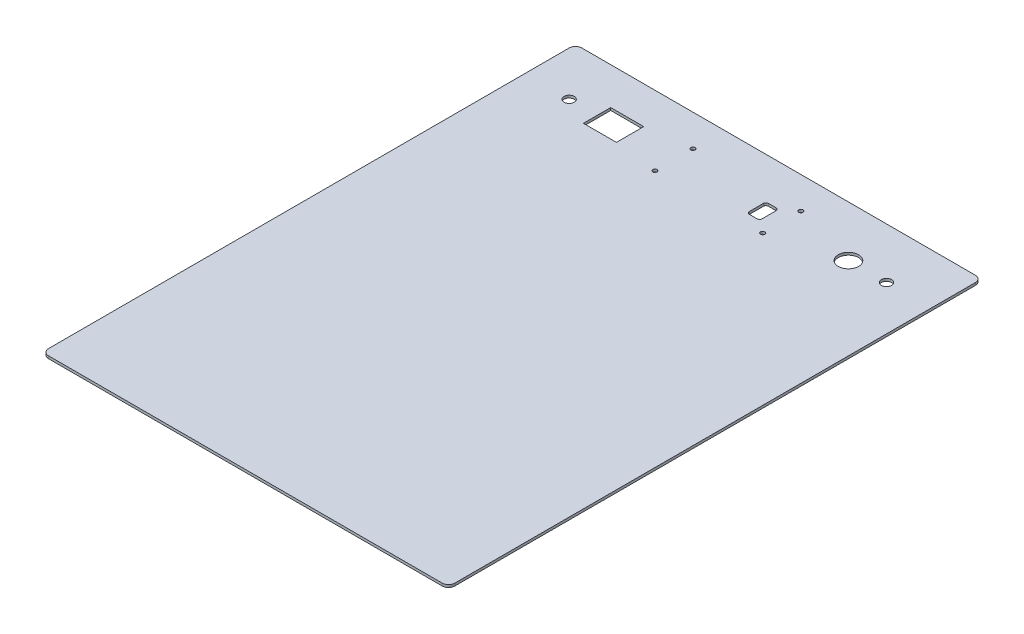
ISO-10303-21;
HEADER;
FILE_DESCRIPTION(('STEP AP214'),'2;1');
FILE_NAME('part.step','',(''),(''),'','','');
FILE_SCHEMA(('AUTOMOTIVE_DESIGN { 1 0 10303 214 1 1 1 1 }'));
ENDSEC;
DATA;
#1=APPLICATION_CONTEXT('core data for automotive mechanical design processes');
#2=APPLICATION_PROTOCOL_DEFINITION('international standard','automotive_design',2000,#1);
#3=PRODUCT_CONTEXT('',#1,'mechanical');
#4=PRODUCT('Part','Part','',(#3));
#5=PRODUCT_RELATED_PRODUCT_CATEGORY('part','',(#4));
#6=PRODUCT_DEFINITION_FORMATION('','',#4);
#7=PRODUCT_DEFINITION_CONTEXT('part definition',#1,'design');
#8=PRODUCT_DEFINITION('design','',#6,#7);
#9=PRODUCT_DEFINITION_SHAPE('','',#8);
#10=(LENGTH_UNIT() NAMED_UNIT(*) SI_UNIT(.MILLI.,.METRE.));
#11=(NAMED_UNIT(*) PLANE_ANGLE_UNIT() SI_UNIT($,.RADIAN.));
#12=(NAMED_UNIT(*) SI_UNIT($,.STERADIAN.) SOLID_ANGLE_UNIT());
#13=UNCERTAINTY_MEASURE_WITH_UNIT(LENGTH_MEASURE(1.E-05),#10,'distance_accuracy_value','');
#14=(GEOMETRIC_REPRESENTATION_CONTEXT(3) GLOBAL_UNCERTAINTY_ASSIGNED_CONTEXT((#13)) GLOBAL_UNIT_ASSIGNED_CONTEXT((#10,
#11,#12)) REPRESENTATION_CONTEXT('',''));
#15=CARTESIAN_POINT('',(0.,0.,0.));
#16=DIRECTION('',(0.,0.,1.));
#17=DIRECTION('',(1.,0.,0.));
#18=AXIS2_PLACEMENT_3D('',#15,#16,#17);
#19=CARTESIAN_POINT('',(160.,2.,-210.));
#20=DIRECTION('',(-1.,0.,0.));
#21=DIRECTION('',(0.,0.,1.));
#22=AXIS2_PLACEMENT_3D('',#19,#20,#21);
#23=PLANE('',#22);
#24=DIRECTION('',(0.,0.,-1.));
#25=VECTOR('',#24,1.);
#26=CARTESIAN_POINT('',(160.,2.,-210.));
#27=LINE('',#26,#25);
#28=CARTESIAN_POINT('',(160.,2.,205.));
#29=VERTEX_POINT('',#28);
#30=CARTESIAN_POINT('',(160.,2.,-205.));
#31=VERTEX_POINT('',#30);
#32=EDGE_CURVE('E266',#29,#31,#27,.T.);
#33=ORIENTED_EDGE('',*,*,#32,.F.);
#34=DIRECTION('',(0.,-1.,0.));
#35=VECTOR('',#34,1.);
#36=CARTESIAN_POINT('',(160.,2.,205.));
#37=LINE('',#36,#35);
#38=CARTESIAN_POINT('',(160.,0.,205.));
#39=VERTEX_POINT('',#38);
#40=EDGE_CURVE('E291',#29,#39,#37,.T.);
#41=ORIENTED_EDGE('',*,*,#40,.T.);
#42=DIRECTION('',(0.,0.,-1.));
#43=VECTOR('',#42,1.);
#44=CARTESIAN_POINT('',(160.,0.,-210.));
#45=LINE('',#44,#43);
#46=CARTESIAN_POINT('',(160.,0.,-205.));
#47=VERTEX_POINT('',#46);
#48=EDGE_CURVE('E255',#39,#47,#45,.T.);
#49=ORIENTED_EDGE('',*,*,#48,.T.);
#50=DIRECTION('',(0.,-1.,0.));
#51=VECTOR('',#50,1.);
#52=CARTESIAN_POINT('',(160.,2.,-205.));
#53=LINE('',#52,#51);
#54=EDGE_CURVE('E279',#47,#31,#53,.F.);
#55=ORIENTED_EDGE('',*,*,#54,.T.);
#56=EDGE_LOOP('',(#33,#41,#49,#55));
#57=FACE_BOUND('',#56,.T.);
#58=ADVANCED_FACE('F33',(#57),#23,.F.);
#59=CARTESIAN_POINT('',(-160.,2.,-210.));
#60=DIRECTION('',(0.,0.,1.));
#61=DIRECTION('',(1.,0.,0.));
#62=AXIS2_PLACEMENT_3D('',#59,#60,#61);
#63=PLANE('',#62);
#64=DIRECTION('',(-1.,0.,0.));
#65=VECTOR('',#64,1.);
#66=CARTESIAN_POINT('',(-160.,0.,-210.));
#67=LINE('',#66,#65);
#68=CARTESIAN_POINT('',(155.,0.,-210.));
#69=VERTEX_POINT('',#68);
#70=CARTESIAN_POINT('',(-155.,0.,-210.));
#71=VERTEX_POINT('',#70);
#72=EDGE_CURVE('E282',#69,#71,#67,.T.);
#73=ORIENTED_EDGE('',*,*,#72,.T.);
#74=DIRECTION('',(0.,-1.,0.));
#75=VECTOR('',#74,1.);
#76=CARTESIAN_POINT('',(-155.,2.,-210.));
#77=LINE('',#76,#75);
#78=CARTESIAN_POINT('',(-155.,2.,-210.));
#79=VERTEX_POINT('',#78);
#80=EDGE_CURVE('E323',#71,#79,#77,.F.);
#81=ORIENTED_EDGE('',*,*,#80,.T.);
#82=DIRECTION('',(-1.,0.,0.));
#83=VECTOR('',#82,1.);
#84=CARTESIAN_POINT('',(-160.,2.,-210.));
#85=LINE('',#84,#83);
#86=CARTESIAN_POINT('',(155.,2.,-210.));
#87=VERTEX_POINT('',#86);
#88=EDGE_CURVE('E269',#87,#79,#85,.T.);
#89=ORIENTED_EDGE('',*,*,#88,.F.);
#90=DIRECTION('',(0.,-1.,0.));
#91=VECTOR('',#90,1.);
#92=CARTESIAN_POINT('',(155.,2.,-210.));
#93=LINE('',#92,#91);
#94=EDGE_CURVE('E320',#87,#69,#93,.T.);
#95=ORIENTED_EDGE('',*,*,#94,.T.);
#96=EDGE_LOOP('',(#73,#81,#89,#95));
#97=FACE_BOUND('',#96,.T.);
#98=ADVANCED_FACE('F394',(#97),#63,.F.);
#99=CARTESIAN_POINT('',(-160.,2.,-210.));
#100=DIRECTION('',(1.,0.,0.));
#101=DIRECTION('',(0.,0.,-1.));
#102=AXIS2_PLACEMENT_3D('',#99,#100,#101);
#103=PLANE('',#102);
#104=DIRECTION('',(0.,0.,1.));
#105=VECTOR('',#104,1.);
#106=CARTESIAN_POINT('',(-160.,0.,-210.));
#107=LINE('',#106,#105);
#108=CARTESIAN_POINT('',(-160.,0.,-205.));
#109=VERTEX_POINT('',#108);
#110=CARTESIAN_POINT('',(-160.,0.,205.));
#111=VERTEX_POINT('',#110);
#112=EDGE_CURVE('E285',#109,#111,#107,.T.);
#113=ORIENTED_EDGE('',*,*,#112,.T.);
#114=DIRECTION('',(0.,-1.,0.));
#115=VECTOR('',#114,1.);
#116=CARTESIAN_POINT('',(-160.,2.,205.));
#117=LINE('',#116,#115);
#118=CARTESIAN_POINT('',(-160.,2.,205.));
#119=VERTEX_POINT('',#118);
#120=EDGE_CURVE('E318',#111,#119,#117,.F.);
#121=ORIENTED_EDGE('',*,*,#120,.T.);
#122=DIRECTION('',(0.,0.,1.));
#123=VECTOR('',#122,1.);
#124=CARTESIAN_POINT('',(-160.,2.,-210.));
#125=LINE('',#124,#123);
#126=CARTESIAN_POINT('',(-160.,2.,-205.));
#127=VERTEX_POINT('',#126);
#128=EDGE_CURVE('E273',#127,#119,#125,.T.);
#129=ORIENTED_EDGE('',*,*,#128,.F.);
#130=DIRECTION('',(0.,-1.,0.));
#131=VECTOR('',#130,1.);
#132=CARTESIAN_POINT('',(-160.,2.,-205.));
#133=LINE('',#132,#131);
#134=EDGE_CURVE('E315',#127,#109,#133,.T.);
#135=ORIENTED_EDGE('',*,*,#134,.T.);
#136=EDGE_LOOP('',(#113,#121,#129,#135));
#137=FACE_BOUND('',#136,.T.);
#138=ADVANCED_FACE('F400',(#137),#103,.F.);
#139=CARTESIAN_POINT('',(-160.,2.,210.));
#140=DIRECTION('',(0.,0.,-1.));
#141=DIRECTION('',(-1.,0.,0.));
#142=AXIS2_PLACEMENT_3D('',#139,#140,#141);
#143=PLANE('',#142);
#144=DIRECTION('',(1.,0.,0.));
#145=VECTOR('',#144,1.);
#146=CARTESIAN_POINT('',(-160.,0.,210.));
#147=LINE('',#146,#145);
#148=CARTESIAN_POINT('',(-155.,0.,210.));
#149=VERTEX_POINT('',#148);
#150=CARTESIAN_POINT('',(155.,0.,210.));
#151=VERTEX_POINT('',#150);
#152=EDGE_CURVE('E270',#149,#151,#147,.T.);
#153=ORIENTED_EDGE('',*,*,#152,.T.);
#154=DIRECTION('',(0.,-1.,0.));
#155=VECTOR('',#154,1.);
#156=CARTESIAN_POINT('',(155.,2.,210.));
#157=LINE('',#156,#155);
#158=CARTESIAN_POINT('',(155.,2.,210.));
#159=VERTEX_POINT('',#158);
#160=EDGE_CURVE('E305',#151,#159,#157,.F.);
#161=ORIENTED_EDGE('',*,*,#160,.T.);
#162=DIRECTION('',(1.,0.,0.));
#163=VECTOR('',#162,1.);
#164=CARTESIAN_POINT('',(-160.,2.,210.));
#165=LINE('',#164,#163);
#166=CARTESIAN_POINT('',(-155.,2.,210.));
#167=VERTEX_POINT('',#166);
#168=EDGE_CURVE('E276',#167,#159,#165,.T.);
#169=ORIENTED_EDGE('',*,*,#168,.F.);
#170=DIRECTION('',(0.,-1.,0.));
#171=VECTOR('',#170,1.);
#172=CARTESIAN_POINT('',(-155.,2.,210.));
#173=LINE('',#172,#171);
#174=EDGE_CURVE('E302',#167,#149,#173,.T.);
#175=ORIENTED_EDGE('',*,*,#174,.T.);
#176=EDGE_LOOP('',(#153,#161,#169,#175));
#177=FACE_BOUND('',#176,.T.);
#178=ADVANCED_FACE('F604',(#177),#143,.F.);
#179=CARTESIAN_POINT('',(0.,2.,0.));
#180=DIRECTION('',(0.,1.,0.));
#181=DIRECTION('',(0.,0.,1.));
#182=AXIS2_PLACEMENT_3D('',#179,#180,#181);
#183=PLANE('',#182);
#184=CARTESIAN_POINT('',(125.,2.,-170.));
#185=DIRECTION('',(0.,1.,0.));
#186=DIRECTION('',(0.,0.,1.));
#187=AXIS2_PLACEMENT_3D('',#184,#185,#186);
#188=CIRCLE('',#187,3.99999999999999);
#189=CARTESIAN_POINT('',(125.,2.,-166.));
#190=VERTEX_POINT('',#189);
#191=EDGE_CURVE('E202',#190,#190,#188,.T.);
#192=ORIENTED_EDGE('',*,*,#191,.F.);
#193=EDGE_LOOP('',(#192));
#194=FACE_BOUND('',#193,.T.);
#195=CARTESIAN_POINT('',(95.0000000000001,2.,-170.));
#196=DIRECTION('',(0.,1.,0.));
#197=DIRECTION('',(0.,0.,1.));
#198=AXIS2_PLACEMENT_3D('',#195,#196,#197);
#199=CIRCLE('',#198,8.00000000000001);
#200=CARTESIAN_POINT('',(95.0000000000001,2.,-162.));
#201=VERTEX_POINT('',#200);
#202=EDGE_CURVE('E678',#201,#201,#199,.T.);
#203=ORIENTED_EDGE('',*,*,#202,.F.);
#204=EDGE_LOOP('',(#203));
#205=FACE_BOUND('',#204,.T.);
#206=CARTESIAN_POINT('',(-125.,2.,-170.));
#207=DIRECTION('',(0.,1.,0.));
#208=DIRECTION('',(0.,0.,1.));
#209=AXIS2_PLACEMENT_3D('',#206,#207,#208);
#210=CIRCLE('',#209,3.99999999999999);
#211=CARTESIAN_POINT('',(-125.,2.,-166.));
#212=VERTEX_POINT('',#211);
#213=EDGE_CURVE('E682',#212,#212,#210,.T.);
#214=ORIENTED_EDGE('',*,*,#213,.F.);
#215=EDGE_LOOP('',(#214));
#216=FACE_BOUND('',#215,.T.);
#217=DIRECTION('',(0.,0.,-1.));
#218=VECTOR('',#217,1.);
#219=CARTESIAN_POINT('',(-77.,2.,-180.75));
#220=LINE('',#219,#218);
#221=CARTESIAN_POINT('',(-77.,2.,-159.25));
#222=VERTEX_POINT('',#221);
#223=CARTESIAN_POINT('',(-77.,2.,-180.75));
#224=VERTEX_POINT('',#223);
#225=EDGE_CURVE('E178',#222,#224,#220,.T.);
#226=ORIENTED_EDGE('',*,*,#225,.F.);
#227=DIRECTION('',(1.,0.,0.));
#228=VECTOR('',#227,1.);
#229=CARTESIAN_POINT('',(-103.,2.,-159.25));
#230=LINE('',#229,#228);
#231=CARTESIAN_POINT('',(-103.,2.,-159.25));
#232=VERTEX_POINT('',#231);
#233=EDGE_CURVE('E196',#232,#222,#230,.T.);
#234=ORIENTED_EDGE('',*,*,#233,.F.);
#235=DIRECTION('',(0.,0.,1.));
#236=VECTOR('',#235,1.);
#237=CARTESIAN_POINT('',(-103.,2.,-180.75));
#238=LINE('',#237,#236);
#239=CARTESIAN_POINT('',(-103.,2.,-180.75));
#240=VERTEX_POINT('',#239);
#241=EDGE_CURVE('E199',#240,#232,#238,.T.);
#242=ORIENTED_EDGE('',*,*,#241,.F.);
#243=DIRECTION('',(-1.,0.,0.));
#244=VECTOR('',#243,1.);
#245=CARTESIAN_POINT('',(-103.,2.,-180.75));
#246=LINE('',#245,#244);
#247=EDGE_CURVE('E208',#224,#240,#246,.T.);
#248=ORIENTED_EDGE('',*,*,#247,.F.);
#249=EDGE_LOOP('',(#226,#234,#242,#248));
#250=FACE_BOUND('',#249,.T.);
#251=CARTESIAN_POINT('',(42.5,2.,-155.));
#252=DIRECTION('',(0.,1.,0.));
#253=DIRECTION('',(0.,0.,1.));
#254=AXIS2_PLACEMENT_3D('',#251,#252,#253);
#255=CIRCLE('',#254,1.7);
#256=CARTESIAN_POINT('',(42.5,2.,-153.3));
#257=VERTEX_POINT('',#256);
#258=EDGE_CURVE('E238',#257,#257,#255,.T.);
#259=ORIENTED_EDGE('',*,*,#258,.F.);
#260=EDGE_LOOP('',(#259));
#261=FACE_BOUND('',#260,.T.);
#262=CARTESIAN_POINT('',(-42.5,2.,-155.));
#263=DIRECTION('',(0.,1.,0.));
#264=DIRECTION('',(0.,0.,1.));
#265=AXIS2_PLACEMENT_3D('',#262,#263,#264);
#266=CIRCLE('',#265,1.7);
#267=CARTESIAN_POINT('',(-42.5,2.,-153.3));
#268=VERTEX_POINT('',#267);
#269=EDGE_CURVE('E232',#268,#268,#266,.T.);
#270=ORIENTED_EDGE('',*,*,#269,.F.);
#271=EDGE_LOOP('',(#270));
#272=FACE_BOUND('',#271,.T.);
#273=CARTESIAN_POINT('',(-42.5,2.,-185.));
#274=DIRECTION('',(0.,1.,0.));
#275=DIRECTION('',(0.,0.,1.));
#276=AXIS2_PLACEMENT_3D('',#273,#274,#275);
#277=CIRCLE('',#276,1.7);
#278=CARTESIAN_POINT('',(-42.5,2.,-183.3));
#279=VERTEX_POINT('',#278);
#280=EDGE_CURVE('E226',#279,#279,#277,.T.);
#281=ORIENTED_EDGE('',*,*,#280,.F.);
#282=EDGE_LOOP('',(#281));
#283=FACE_BOUND('',#282,.T.);
#284=CARTESIAN_POINT('',(42.5,2.,-185.));
#285=DIRECTION('',(0.,1.,0.));
#286=DIRECTION('',(0.,0.,1.));
#287=AXIS2_PLACEMENT_3D('',#284,#285,#286);
#288=CIRCLE('',#287,1.7);
#289=CARTESIAN_POINT('',(42.5,2.,-183.3));
#290=VERTEX_POINT('',#289);
#291=EDGE_CURVE('E219',#290,#290,#288,.T.);
#292=ORIENTED_EDGE('',*,*,#291,.F.);
#293=EDGE_LOOP('',(#292));
#294=FACE_BOUND('',#293,.T.);
#295=DIRECTION('',(1.,0.,0.));
#296=VECTOR('',#295,1.);
#297=CARTESIAN_POINT('',(22.5,2.,-162.5));
#298=LINE('',#297,#296);
#299=CARTESIAN_POINT('',(24.5,2.,-162.5));
#300=VERTEX_POINT('',#299);
#301=CARTESIAN_POINT('',(30.5,2.,-162.5));
#302=VERTEX_POINT('',#301);
#303=EDGE_CURVE('E222',#300,#302,#298,.T.);
#304=ORIENTED_EDGE('',*,*,#303,.F.);
#305=CARTESIAN_POINT('',(24.5,2.,-164.5));
#306=DIRECTION('',(0.,1.,0.));
#307=DIRECTION('',(0.,0.,1.));
#308=AXIS2_PLACEMENT_3D('',#305,#306,#307);
#309=CIRCLE('',#308,2.);
#310=CARTESIAN_POINT('',(22.5,2.,-164.5));
#311=VERTEX_POINT('',#310);
#312=EDGE_CURVE('E344',#300,#311,#309,.F.);
#313=ORIENTED_EDGE('',*,*,#312,.T.);
#314=DIRECTION('',(0.,0.,1.));
#315=VECTOR('',#314,1.);
#316=CARTESIAN_POINT('',(22.5,2.,-177.5));
#317=LINE('',#316,#315);
#318=CARTESIAN_POINT('',(22.5,2.,-175.5));
#319=VERTEX_POINT('',#318);
#320=EDGE_CURVE('E247',#319,#311,#317,.T.);
#321=ORIENTED_EDGE('',*,*,#320,.F.);
#322=CARTESIAN_POINT('',(24.5,2.,-175.5));
#323=DIRECTION('',(0.,1.,0.));
#324=DIRECTION('',(0.,0.,1.));
#325=AXIS2_PLACEMENT_3D('',#322,#323,#324);
#326=CIRCLE('',#325,2.);
#327=CARTESIAN_POINT('',(24.5,2.,-177.5));
#328=VERTEX_POINT('',#327);
#329=EDGE_CURVE('E41',#319,#328,#326,.F.);
#330=ORIENTED_EDGE('',*,*,#329,.T.);
#331=DIRECTION('',(1.,0.,0.));
#332=VECTOR('',#331,1.);
#333=CARTESIAN_POINT('',(22.5,2.,-177.5));
#334=LINE('',#333,#332);
#335=CARTESIAN_POINT('',(30.5,2.,-177.5));
#336=VERTEX_POINT('',#335);
#337=EDGE_CURVE('E261',#328,#336,#334,.T.);
#338=ORIENTED_EDGE('',*,*,#337,.T.);
#339=CARTESIAN_POINT('',(30.5,2.,-175.5));
#340=DIRECTION('',(0.,1.,0.));
#341=DIRECTION('',(0.,0.,1.));
#342=AXIS2_PLACEMENT_3D('',#339,#340,#341);
#343=CIRCLE('',#342,2.);
#344=CARTESIAN_POINT('',(32.5,2.,-175.5));
#345=VERTEX_POINT('',#344);
#346=EDGE_CURVE('E352',#336,#345,#343,.F.);
#347=ORIENTED_EDGE('',*,*,#346,.T.);
#348=DIRECTION('',(0.,0.,1.));
#349=VECTOR('',#348,1.);
#350=CARTESIAN_POINT('',(32.5,2.,-177.5));
#351=LINE('',#350,#349);
#352=CARTESIAN_POINT('',(32.5,2.,-164.5));
#353=VERTEX_POINT('',#352);
#354=EDGE_CURVE('E258',#345,#353,#351,.T.);
#355=ORIENTED_EDGE('',*,*,#354,.T.);
#356=CARTESIAN_POINT('',(30.5,2.,-164.5));
#357=DIRECTION('',(0.,1.,0.));
#358=DIRECTION('',(0.,0.,1.));
#359=AXIS2_PLACEMENT_3D('',#356,#357,#358);
#360=CIRCLE('',#359,2.);
#361=EDGE_CURVE('E348',#353,#302,#360,.F.);
#362=ORIENTED_EDGE('',*,*,#361,.T.);
#363=EDGE_LOOP('',(#304,#313,#321,#330,#338,#347,#355,#362));
#364=FACE_BOUND('',#363,.T.);
#365=ORIENTED_EDGE('',*,*,#168,.T.);
#366=CARTESIAN_POINT('',(155.,2.,205.));
#367=DIRECTION('',(0.,1.,0.));
#368=DIRECTION('',(0.,0.,1.));
#369=AXIS2_PLACEMENT_3D('',#366,#367,#368);
#370=CIRCLE('',#369,5.);
#371=EDGE_CURVE('E313',#159,#29,#370,.T.);
#372=ORIENTED_EDGE('',*,*,#371,.T.);
#373=ORIENTED_EDGE('',*,*,#32,.T.);
#374=CARTESIAN_POINT('',(155.,2.,-205.));
#375=DIRECTION('',(0.,1.,0.));
#376=DIRECTION('',(0.,0.,1.));
#377=AXIS2_PLACEMENT_3D('',#374,#375,#376);
#378=CIRCLE('',#377,5.);
#379=EDGE_CURVE('E307',#31,#87,#378,.T.);
#380=ORIENTED_EDGE('',*,*,#379,.T.);
#381=ORIENTED_EDGE('',*,*,#88,.T.);
#382=CARTESIAN_POINT('',(-155.,2.,-205.));
#383=DIRECTION('',(0.,1.,0.));
#384=DIRECTION('',(0.,0.,1.));
#385=AXIS2_PLACEMENT_3D('',#382,#383,#384);
#386=CIRCLE('',#385,5.);
#387=EDGE_CURVE('E309',#79,#127,#386,.T.);
#388=ORIENTED_EDGE('',*,*,#387,.T.);
#389=ORIENTED_EDGE('',*,*,#128,.T.);
#390=CARTESIAN_POINT('',(-155.,2.,205.));
#391=DIRECTION('',(0.,1.,0.));
#392=DIRECTION('',(0.,0.,1.));
#393=AXIS2_PLACEMENT_3D('',#390,#391,#392);
#394=CIRCLE('',#393,5.);
#395=EDGE_CURVE('E311',#119,#167,#394,.T.);
#396=ORIENTED_EDGE('',*,*,#395,.T.);
#397=EDGE_LOOP('',(#365,#372,#373,#380,#381,#388,#389,#396));
#398=FACE_BOUND('',#397,.T.);
#399=ADVANCED_FACE('F357',(#194,#205,#216,#250,#261,#272,#283,#294,#364,#398),#183,.T.);
#400=CARTESIAN_POINT('',(0.,0.,0.));
#401=DIRECTION('',(0.,1.,0.));
#402=DIRECTION('',(0.,0.,1.));
#403=AXIS2_PLACEMENT_3D('',#400,#401,#402);
#404=PLANE('',#403);
#405=CARTESIAN_POINT('',(125.,0.,-170.));
#406=DIRECTION('',(0.,1.,0.));
#407=DIRECTION('',(0.,0.,1.));
#408=AXIS2_PLACEMENT_3D('',#405,#406,#407);
#409=CIRCLE('',#408,3.99999999999999);
#410=CARTESIAN_POINT('',(125.,0.,-166.));
#411=VERTEX_POINT('',#410);
#412=EDGE_CURVE('E705',#411,#411,#409,.T.);
#413=ORIENTED_EDGE('',*,*,#412,.T.);
#414=EDGE_LOOP('',(#413));
#415=FACE_BOUND('',#414,.T.);
#416=CARTESIAN_POINT('',(95.0000000000001,0.,-170.));
#417=DIRECTION('',(0.,1.,0.));
#418=DIRECTION('',(0.,0.,1.));
#419=AXIS2_PLACEMENT_3D('',#416,#417,#418);
#420=CIRCLE('',#419,8.00000000000001);
#421=CARTESIAN_POINT('',(95.0000000000001,0.,-162.));
#422=VERTEX_POINT('',#421);
#423=EDGE_CURVE('E698',#422,#422,#420,.T.);
#424=ORIENTED_EDGE('',*,*,#423,.T.);
#425=EDGE_LOOP('',(#424));
#426=FACE_BOUND('',#425,.T.);
#427=CARTESIAN_POINT('',(-125.,0.,-170.));
#428=DIRECTION('',(0.,1.,0.));
#429=DIRECTION('',(0.,0.,1.));
#430=AXIS2_PLACEMENT_3D('',#427,#428,#429);
#431=CIRCLE('',#430,3.99999999999999);
#432=CARTESIAN_POINT('',(-125.,0.,-166.));
#433=VERTEX_POINT('',#432);
#434=EDGE_CURVE('E209',#433,#433,#431,.T.);
#435=ORIENTED_EDGE('',*,*,#434,.T.);
#436=EDGE_LOOP('',(#435));
#437=FACE_BOUND('',#436,.T.);
#438=DIRECTION('',(1.,0.,0.));
#439=VECTOR('',#438,1.);
#440=CARTESIAN_POINT('',(-103.,0.,-159.25));
#441=LINE('',#440,#439);
#442=CARTESIAN_POINT('',(-103.,0.,-159.25));
#443=VERTEX_POINT('',#442);
#444=CARTESIAN_POINT('',(-77.,0.,-159.25));
#445=VERTEX_POINT('',#444);
#446=EDGE_CURVE('E183',#443,#445,#441,.T.);
#447=ORIENTED_EDGE('',*,*,#446,.T.);
#448=DIRECTION('',(0.,0.,-1.));
#449=VECTOR('',#448,1.);
#450=CARTESIAN_POINT('',(-77.,0.,-180.75));
#451=LINE('',#450,#449);
#452=CARTESIAN_POINT('',(-77.,0.,-180.75));
#453=VERTEX_POINT('',#452);
#454=EDGE_CURVE('E175',#445,#453,#451,.T.);
#455=ORIENTED_EDGE('',*,*,#454,.T.);
#456=DIRECTION('',(-1.,0.,0.));
#457=VECTOR('',#456,1.);
#458=CARTESIAN_POINT('',(-103.,0.,-180.75));
#459=LINE('',#458,#457);
#460=CARTESIAN_POINT('',(-103.,0.,-180.75));
#461=VERTEX_POINT('',#460);
#462=EDGE_CURVE('E187',#453,#461,#459,.T.);
#463=ORIENTED_EDGE('',*,*,#462,.T.);
#464=DIRECTION('',(0.,0.,1.));
#465=VECTOR('',#464,1.);
#466=CARTESIAN_POINT('',(-103.,0.,-180.75));
#467=LINE('',#466,#465);
#468=EDGE_CURVE('E191',#461,#443,#467,.T.);
#469=ORIENTED_EDGE('',*,*,#468,.T.);
#470=EDGE_LOOP('',(#447,#455,#463,#469));
#471=FACE_BOUND('',#470,.T.);
#472=CARTESIAN_POINT('',(42.5,0.,-155.));
#473=DIRECTION('',(0.,1.,0.));
#474=DIRECTION('',(0.,0.,1.));
#475=AXIS2_PLACEMENT_3D('',#472,#473,#474);
#476=CIRCLE('',#475,1.7);
#477=CARTESIAN_POINT('',(42.5,0.,-153.3));
#478=VERTEX_POINT('',#477);
#479=EDGE_CURVE('E215',#478,#478,#476,.T.);
#480=ORIENTED_EDGE('',*,*,#479,.T.);
#481=EDGE_LOOP('',(#480));
#482=FACE_BOUND('',#481,.T.);
#483=CARTESIAN_POINT('',(-42.5,0.,-155.));
#484=DIRECTION('',(0.,1.,0.));
#485=DIRECTION('',(0.,0.,1.));
#486=AXIS2_PLACEMENT_3D('',#483,#484,#485);
#487=CIRCLE('',#486,1.7);
#488=CARTESIAN_POINT('',(-42.5,0.,-153.3));
#489=VERTEX_POINT('',#488);
#490=EDGE_CURVE('E235',#489,#489,#487,.T.);
#491=ORIENTED_EDGE('',*,*,#490,.T.);
#492=EDGE_LOOP('',(#491));
#493=FACE_BOUND('',#492,.T.);
#494=CARTESIAN_POINT('',(-42.5,0.,-185.));
#495=DIRECTION('',(0.,1.,0.));
#496=DIRECTION('',(0.,0.,1.));
#497=AXIS2_PLACEMENT_3D('',#494,#495,#496);
#498=CIRCLE('',#497,1.7);
#499=CARTESIAN_POINT('',(-42.5,0.,-183.3));
#500=VERTEX_POINT('',#499);
#501=EDGE_CURVE('E229',#500,#500,#498,.T.);
#502=ORIENTED_EDGE('',*,*,#501,.T.);
#503=EDGE_LOOP('',(#502));
#504=FACE_BOUND('',#503,.T.);
#505=CARTESIAN_POINT('',(42.5,0.,-185.));
#506=DIRECTION('',(0.,1.,0.));
#507=DIRECTION('',(0.,0.,1.));
#508=AXIS2_PLACEMENT_3D('',#505,#506,#507);
#509=CIRCLE('',#508,1.7);
#510=CARTESIAN_POINT('',(42.5,0.,-183.3));
#511=VERTEX_POINT('',#510);
#512=EDGE_CURVE('E223',#511,#511,#509,.T.);
#513=ORIENTED_EDGE('',*,*,#512,.T.);
#514=EDGE_LOOP('',(#513));
#515=FACE_BOUND('',#514,.T.);
#516=DIRECTION('',(1.,0.,0.));
#517=VECTOR('',#516,1.);
#518=CARTESIAN_POINT('',(22.5,0.,-177.5));
#519=LINE('',#518,#517);
#520=CARTESIAN_POINT('',(24.5,0.,-177.5));
#521=VERTEX_POINT('',#520);
#522=CARTESIAN_POINT('',(30.5,0.,-177.5));
#523=VERTEX_POINT('',#522);
#524=EDGE_CURVE('E250',#521,#523,#519,.T.);
#525=ORIENTED_EDGE('',*,*,#524,.F.);
#526=CARTESIAN_POINT('',(24.5,0.,-175.5));
#527=DIRECTION('',(0.,1.,0.));
#528=DIRECTION('',(0.,0.,1.));
#529=AXIS2_PLACEMENT_3D('',#526,#527,#528);
#530=CIRCLE('',#529,2.);
#531=CARTESIAN_POINT('',(22.5,0.,-175.5));
#532=VERTEX_POINT('',#531);
#533=EDGE_CURVE('E11',#521,#532,#530,.T.);
#534=ORIENTED_EDGE('',*,*,#533,.T.);
#535=DIRECTION('',(0.,0.,1.));
#536=VECTOR('',#535,1.);
#537=CARTESIAN_POINT('',(22.5,0.,-177.5));
#538=LINE('',#537,#536);
#539=CARTESIAN_POINT('',(22.5,0.,-164.5));
#540=VERTEX_POINT('',#539);
#541=EDGE_CURVE('E252',#532,#540,#538,.T.);
#542=ORIENTED_EDGE('',*,*,#541,.T.);
#543=CARTESIAN_POINT('',(24.5,0.,-164.5));
#544=DIRECTION('',(0.,1.,0.));
#545=DIRECTION('',(0.,0.,1.));
#546=AXIS2_PLACEMENT_3D('',#543,#544,#545);
#547=CIRCLE('',#546,2.);
#548=CARTESIAN_POINT('',(24.5,0.,-162.5));
#549=VERTEX_POINT('',#548);
#550=EDGE_CURVE('E346',#540,#549,#547,.T.);
#551=ORIENTED_EDGE('',*,*,#550,.T.);
#552=DIRECTION('',(1.,0.,0.));
#553=VECTOR('',#552,1.);
#554=CARTESIAN_POINT('',(22.5,0.,-162.5));
#555=LINE('',#554,#553);
#556=CARTESIAN_POINT('',(30.5,0.,-162.5));
#557=VERTEX_POINT('',#556);
#558=EDGE_CURVE('E243',#549,#557,#555,.T.);
#559=ORIENTED_EDGE('',*,*,#558,.T.);
#560=CARTESIAN_POINT('',(30.5,0.,-164.5));
#561=DIRECTION('',(0.,1.,0.));
#562=DIRECTION('',(0.,0.,1.));
#563=AXIS2_PLACEMENT_3D('',#560,#561,#562);
#564=CIRCLE('',#563,2.);
#565=CARTESIAN_POINT('',(32.5,0.,-164.5));
#566=VERTEX_POINT('',#565);
#567=EDGE_CURVE('E350',#557,#566,#564,.T.);
#568=ORIENTED_EDGE('',*,*,#567,.T.);
#569=DIRECTION('',(0.,0.,1.));
#570=VECTOR('',#569,1.);
#571=CARTESIAN_POINT('',(32.5,0.,-177.5));
#572=LINE('',#571,#570);
#573=CARTESIAN_POINT('',(32.5,0.,-175.5));
#574=VERTEX_POINT('',#573);
#575=EDGE_CURVE('E246',#574,#566,#572,.T.);
#576=ORIENTED_EDGE('',*,*,#575,.F.);
#577=CARTESIAN_POINT('',(30.5,0.,-175.5));
#578=DIRECTION('',(0.,1.,0.));
#579=DIRECTION('',(0.,0.,1.));
#580=AXIS2_PLACEMENT_3D('',#577,#578,#579);
#581=CIRCLE('',#580,2.);
#582=EDGE_CURVE('E48',#574,#523,#581,.T.);
#583=ORIENTED_EDGE('',*,*,#582,.T.);
#584=EDGE_LOOP('',(#525,#534,#542,#551,#559,#568,#576,#583));
#585=FACE_BOUND('',#584,.T.);
#586=ORIENTED_EDGE('',*,*,#48,.F.);
#587=CARTESIAN_POINT('',(155.,0.,205.));
#588=DIRECTION('',(0.,1.,0.));
#589=DIRECTION('',(0.,0.,1.));
#590=AXIS2_PLACEMENT_3D('',#587,#588,#589);
#591=CIRCLE('',#590,5.);
#592=EDGE_CURVE('E300',#39,#151,#591,.F.);
#593=ORIENTED_EDGE('',*,*,#592,.T.);
#594=ORIENTED_EDGE('',*,*,#152,.F.);
#595=CARTESIAN_POINT('',(-155.,0.,205.));
#596=DIRECTION('',(0.,1.,0.));
#597=DIRECTION('',(0.,0.,1.));
#598=AXIS2_PLACEMENT_3D('',#595,#596,#597);
#599=CIRCLE('',#598,5.);
#600=EDGE_CURVE('E298',#149,#111,#599,.F.);
#601=ORIENTED_EDGE('',*,*,#600,.T.);
#602=ORIENTED_EDGE('',*,*,#112,.F.);
#603=CARTESIAN_POINT('',(-155.,0.,-205.));
#604=DIRECTION('',(0.,1.,0.));
#605=DIRECTION('',(0.,0.,1.));
#606=AXIS2_PLACEMENT_3D('',#603,#604,#605);
#607=CIRCLE('',#606,5.);
#608=EDGE_CURVE('E296',#109,#71,#607,.F.);
#609=ORIENTED_EDGE('',*,*,#608,.T.);
#610=ORIENTED_EDGE('',*,*,#72,.F.);
#611=CARTESIAN_POINT('',(155.,0.,-205.));
#612=DIRECTION('',(0.,1.,0.));
#613=DIRECTION('',(0.,0.,1.));
#614=AXIS2_PLACEMENT_3D('',#611,#612,#613);
#615=CIRCLE('',#614,5.);
#616=EDGE_CURVE('E294',#69,#47,#615,.F.);
#617=ORIENTED_EDGE('',*,*,#616,.T.);
#618=EDGE_LOOP('',(#586,#593,#594,#601,#602,#609,#610,#617));
#619=FACE_BOUND('',#618,.T.);
#620=ADVANCED_FACE('F193',(#415,#426,#437,#471,#482,#493,#504,#515,#585,#619),#404,.F.);
#621=CARTESIAN_POINT('',(22.5,0.,-162.5));
#622=DIRECTION('',(0.,0.,1.));
#623=DIRECTION('',(1.,0.,0.));
#624=AXIS2_PLACEMENT_3D('',#621,#622,#623);
#625=PLANE('',#624);
#626=ORIENTED_EDGE('',*,*,#558,.F.);
#627=DIRECTION('',(0.,1.,0.));
#628=VECTOR('',#627,1.);
#629=CARTESIAN_POINT('',(24.5,2.,-162.5));
#630=LINE('',#629,#628);
#631=EDGE_CURVE('E327',#549,#300,#630,.T.);
#632=ORIENTED_EDGE('',*,*,#631,.T.);
#633=ORIENTED_EDGE('',*,*,#303,.T.);
#634=DIRECTION('',(0.,1.,0.));
#635=VECTOR('',#634,1.);
#636=CARTESIAN_POINT('',(30.5,0.,-162.5));
#637=LINE('',#636,#635);
#638=EDGE_CURVE('E325',#302,#557,#637,.F.);
#639=ORIENTED_EDGE('',*,*,#638,.T.);
#640=EDGE_LOOP('',(#626,#632,#633,#639));
#641=FACE_BOUND('',#640,.T.);
#642=ADVANCED_FACE('F376',(#641),#625,.F.);
#643=CARTESIAN_POINT('',(22.5,0.,-177.5));
#644=DIRECTION('',(-1.,0.,0.));
#645=DIRECTION('',(0.,0.,1.));
#646=AXIS2_PLACEMENT_3D('',#643,#644,#645);
#647=PLANE('',#646);
#648=ORIENTED_EDGE('',*,*,#320,.T.);
#649=DIRECTION('',(0.,1.,0.));
#650=VECTOR('',#649,1.);
#651=CARTESIAN_POINT('',(22.5,0.,-164.5));
#652=LINE('',#651,#650);
#653=EDGE_CURVE('E333',#311,#540,#652,.F.);
#654=ORIENTED_EDGE('',*,*,#653,.T.);
#655=ORIENTED_EDGE('',*,*,#541,.F.);
#656=DIRECTION('',(0.,1.,0.));
#657=VECTOR('',#656,1.);
#658=CARTESIAN_POINT('',(22.5,0.,-175.5));
#659=LINE('',#658,#657);
#660=EDGE_CURVE('E330',#532,#319,#659,.T.);
#661=ORIENTED_EDGE('',*,*,#660,.T.);
#662=EDGE_LOOP('',(#648,#654,#655,#661));
#663=FACE_BOUND('',#662,.T.);
#664=ADVANCED_FACE('F368',(#663),#647,.F.);
#665=CARTESIAN_POINT('',(22.5,0.,-177.5));
#666=DIRECTION('',(0.,0.,1.));
#667=DIRECTION('',(1.,0.,0.));
#668=AXIS2_PLACEMENT_3D('',#665,#666,#667);
#669=PLANE('',#668);
#670=ORIENTED_EDGE('',*,*,#524,.T.);
#671=DIRECTION('',(0.,1.,0.));
#672=VECTOR('',#671,1.);
#673=CARTESIAN_POINT('',(30.5,2.,-177.5));
#674=LINE('',#673,#672);
#675=EDGE_CURVE('E341',#523,#336,#674,.T.);
#676=ORIENTED_EDGE('',*,*,#675,.T.);
#677=ORIENTED_EDGE('',*,*,#337,.F.);
#678=DIRECTION('',(0.,1.,0.));
#679=VECTOR('',#678,1.);
#680=CARTESIAN_POINT('',(24.5,0.,-177.5));
#681=LINE('',#680,#679);
#682=EDGE_CURVE('E55',#328,#521,#681,.F.);
#683=ORIENTED_EDGE('',*,*,#682,.T.);
#684=EDGE_LOOP('',(#670,#676,#677,#683));
#685=FACE_BOUND('',#684,.T.);
#686=ADVANCED_FACE('F361',(#685),#669,.T.);
#687=CARTESIAN_POINT('',(32.5,0.,-177.5));
#688=DIRECTION('',(-1.,0.,0.));
#689=DIRECTION('',(0.,0.,1.));
#690=AXIS2_PLACEMENT_3D('',#687,#688,#689);
#691=PLANE('',#690);
#692=ORIENTED_EDGE('',*,*,#575,.T.);
#693=DIRECTION('',(0.,1.,0.));
#694=VECTOR('',#693,1.);
#695=CARTESIAN_POINT('',(32.5,0.,-164.5));
#696=LINE('',#695,#694);
#697=EDGE_CURVE('E337',#566,#353,#696,.T.);
#698=ORIENTED_EDGE('',*,*,#697,.T.);
#699=ORIENTED_EDGE('',*,*,#354,.F.);
#700=DIRECTION('',(0.,1.,0.));
#701=VECTOR('',#700,1.);
#702=CARTESIAN_POINT('',(32.5,0.,-175.5));
#703=LINE('',#702,#701);
#704=EDGE_CURVE('E335',#345,#574,#703,.F.);
#705=ORIENTED_EDGE('',*,*,#704,.T.);
#706=EDGE_LOOP('',(#692,#698,#699,#705));
#707=FACE_BOUND('',#706,.T.);
#708=ADVANCED_FACE('F382',(#707),#691,.T.);
#709=CARTESIAN_POINT('',(42.5,0.,-185.));
#710=DIRECTION('',(0.,1.,0.));
#711=DIRECTION('',(0.,0.,1.));
#712=AXIS2_PLACEMENT_3D('',#709,#710,#711);
#713=CYLINDRICAL_SURFACE('',#712,1.7);
#714=ORIENTED_EDGE('',*,*,#512,.F.);
#715=EDGE_LOOP('',(#714));
#716=FACE_BOUND('',#715,.T.);
#717=ORIENTED_EDGE('',*,*,#291,.T.);
#718=EDGE_LOOP('',(#717));
#719=FACE_BOUND('',#718,.T.);
#720=ADVANCED_FACE('F553',(#716,#719),#713,.F.);
#721=CARTESIAN_POINT('',(-42.5,0.,-185.));
#722=DIRECTION('',(0.,1.,0.));
#723=DIRECTION('',(0.,0.,1.));
#724=AXIS2_PLACEMENT_3D('',#721,#722,#723);
#725=CYLINDRICAL_SURFACE('',#724,1.7);
#726=ORIENTED_EDGE('',*,*,#501,.F.);
#727=EDGE_LOOP('',(#726));
#728=FACE_BOUND('',#727,.T.);
#729=ORIENTED_EDGE('',*,*,#280,.T.);
#730=EDGE_LOOP('',(#729));
#731=FACE_BOUND('',#730,.T.);
#732=ADVANCED_FACE('F544',(#728,#731),#725,.F.);
#733=CARTESIAN_POINT('',(-42.5,0.,-155.));
#734=DIRECTION('',(0.,1.,0.));
#735=DIRECTION('',(0.,0.,1.));
#736=AXIS2_PLACEMENT_3D('',#733,#734,#735);
#737=CYLINDRICAL_SURFACE('',#736,1.7);
#738=ORIENTED_EDGE('',*,*,#490,.F.);
#739=EDGE_LOOP('',(#738));
#740=FACE_BOUND('',#739,.T.);
#741=ORIENTED_EDGE('',*,*,#269,.T.);
#742=EDGE_LOOP('',(#741));
#743=FACE_BOUND('',#742,.T.);
#744=ADVANCED_FACE('F535',(#740,#743),#737,.F.);
#745=CARTESIAN_POINT('',(42.5,0.,-155.));
#746=DIRECTION('',(0.,1.,0.));
#747=DIRECTION('',(0.,0.,1.));
#748=AXIS2_PLACEMENT_3D('',#745,#746,#747);
#749=CYLINDRICAL_SURFACE('',#748,1.7);
#750=ORIENTED_EDGE('',*,*,#479,.F.);
#751=EDGE_LOOP('',(#750));
#752=FACE_BOUND('',#751,.T.);
#753=ORIENTED_EDGE('',*,*,#258,.T.);
#754=EDGE_LOOP('',(#753));
#755=FACE_BOUND('',#754,.T.);
#756=ADVANCED_FACE('F527',(#752,#755),#749,.F.);
#757=CARTESIAN_POINT('',(-77.,0.,-180.75));
#758=DIRECTION('',(1.,0.,0.));
#759=DIRECTION('',(0.,0.,-1.));
#760=AXIS2_PLACEMENT_3D('',#757,#758,#759);
#761=PLANE('',#760);
#762=ORIENTED_EDGE('',*,*,#225,.T.);
#763=DIRECTION('',(0.,1.,0.));
#764=VECTOR('',#763,1.);
#765=CARTESIAN_POINT('',(-77.,0.,-180.75));
#766=LINE('',#765,#764);
#767=EDGE_CURVE('E171',#453,#224,#766,.T.);
#768=ORIENTED_EDGE('',*,*,#767,.F.);
#769=ORIENTED_EDGE('',*,*,#454,.F.);
#770=DIRECTION('',(0.,1.,0.));
#771=VECTOR('',#770,1.);
#772=CARTESIAN_POINT('',(-77.,0.,-159.25));
#773=LINE('',#772,#771);
#774=EDGE_CURVE('E213',#445,#222,#773,.T.);
#775=ORIENTED_EDGE('',*,*,#774,.T.);
#776=EDGE_LOOP('',(#762,#768,#769,#775));
#777=FACE_BOUND('',#776,.T.);
#778=ADVANCED_FACE('F173',(#777),#761,.F.);
#779=CARTESIAN_POINT('',(-103.,0.,-159.25));
#780=DIRECTION('',(0.,0.,1.));
#781=DIRECTION('',(1.,0.,0.));
#782=AXIS2_PLACEMENT_3D('',#779,#780,#781);
#783=PLANE('',#782);
#784=ORIENTED_EDGE('',*,*,#233,.T.);
#785=ORIENTED_EDGE('',*,*,#774,.F.);
#786=ORIENTED_EDGE('',*,*,#446,.F.);
#787=DIRECTION('',(0.,1.,0.));
#788=VECTOR('',#787,1.);
#789=CARTESIAN_POINT('',(-103.,0.,-159.25));
#790=LINE('',#789,#788);
#791=EDGE_CURVE('E216',#443,#232,#790,.T.);
#792=ORIENTED_EDGE('',*,*,#791,.T.);
#793=EDGE_LOOP('',(#784,#785,#786,#792));
#794=FACE_BOUND('',#793,.T.);
#795=ADVANCED_FACE('F510',(#794),#783,.F.);
#796=CARTESIAN_POINT('',(-103.,0.,-180.75));
#797=DIRECTION('',(-1.,0.,0.));
#798=DIRECTION('',(0.,0.,1.));
#799=AXIS2_PLACEMENT_3D('',#796,#797,#798);
#800=PLANE('',#799);
#801=ORIENTED_EDGE('',*,*,#241,.T.);
#802=ORIENTED_EDGE('',*,*,#791,.F.);
#803=ORIENTED_EDGE('',*,*,#468,.F.);
#804=DIRECTION('',(0.,1.,0.));
#805=VECTOR('',#804,1.);
#806=CARTESIAN_POINT('',(-103.,0.,-180.75));
#807=LINE('',#806,#805);
#808=EDGE_CURVE('E182',#461,#240,#807,.T.);
#809=ORIENTED_EDGE('',*,*,#808,.T.);
#810=EDGE_LOOP('',(#801,#802,#803,#809));
#811=FACE_BOUND('',#810,.T.);
#812=ADVANCED_FACE('F502',(#811),#800,.F.);
#813=CARTESIAN_POINT('',(-103.,0.,-180.75));
#814=DIRECTION('',(0.,0.,-1.));
#815=DIRECTION('',(-1.,0.,0.));
#816=AXIS2_PLACEMENT_3D('',#813,#814,#815);
#817=PLANE('',#816);
#818=ORIENTED_EDGE('',*,*,#247,.T.);
#819=ORIENTED_EDGE('',*,*,#808,.F.);
#820=ORIENTED_EDGE('',*,*,#462,.F.);
#821=ORIENTED_EDGE('',*,*,#767,.T.);
#822=EDGE_LOOP('',(#818,#819,#820,#821));
#823=FACE_BOUND('',#822,.T.);
#824=ADVANCED_FACE('F188',(#823),#817,.F.);
#825=CARTESIAN_POINT('',(-125.,0.,-170.));
#826=DIRECTION('',(0.,1.,0.));
#827=DIRECTION('',(0.,0.,1.));
#828=AXIS2_PLACEMENT_3D('',#825,#826,#827);
#829=CYLINDRICAL_SURFACE('',#828,3.99999999999999);
#830=ORIENTED_EDGE('',*,*,#434,.F.);
#831=EDGE_LOOP('',(#830));
#832=FACE_BOUND('',#831,.T.);
#833=ORIENTED_EDGE('',*,*,#213,.T.);
#834=EDGE_LOOP('',(#833));
#835=FACE_BOUND('',#834,.T.);
#836=ADVANCED_FACE('F485',(#832,#835),#829,.F.);
#837=CARTESIAN_POINT('',(95.0000000000001,0.,-170.));
#838=DIRECTION('',(0.,1.,0.));
#839=DIRECTION('',(0.,0.,1.));
#840=AXIS2_PLACEMENT_3D('',#837,#838,#839);
#841=CYLINDRICAL_SURFACE('',#840,8.00000000000001);
#842=ORIENTED_EDGE('',*,*,#423,.F.);
#843=EDGE_LOOP('',(#842));
#844=FACE_BOUND('',#843,.T.);
#845=ORIENTED_EDGE('',*,*,#202,.T.);
#846=EDGE_LOOP('',(#845));
#847=FACE_BOUND('',#846,.T.);
#848=ADVANCED_FACE('F476',(#844,#847),#841,.F.);
#849=CARTESIAN_POINT('',(125.,0.,-170.));
#850=DIRECTION('',(0.,1.,0.));
#851=DIRECTION('',(0.,0.,1.));
#852=AXIS2_PLACEMENT_3D('',#849,#850,#851);
#853=CYLINDRICAL_SURFACE('',#852,3.99999999999999);
#854=ORIENTED_EDGE('',*,*,#412,.F.);
#855=EDGE_LOOP('',(#854));
#856=FACE_BOUND('',#855,.T.);
#857=ORIENTED_EDGE('',*,*,#191,.T.);
#858=EDGE_LOOP('',(#857));
#859=FACE_BOUND('',#858,.T.);
#860=ADVANCED_FACE('F410',(#856,#859),#853,.F.);
#861=CARTESIAN_POINT('',(155.,2.,205.));
#862=DIRECTION('',(0.,-1.,0.));
#863=DIRECTION('',(0.,0.,-1.));
#864=AXIS2_PLACEMENT_3D('',#861,#862,#863);
#865=CYLINDRICAL_SURFACE('',#864,5.);
#866=ORIENTED_EDGE('',*,*,#371,.F.);
#867=ORIENTED_EDGE('',*,*,#160,.F.);
#868=ORIENTED_EDGE('',*,*,#592,.F.);
#869=ORIENTED_EDGE('',*,*,#40,.F.);
#870=EDGE_LOOP('',(#866,#867,#868,#869));
#871=FACE_BOUND('',#870,.T.);
#872=ADVANCED_FACE('F406',(#871),#865,.T.);
#873=CARTESIAN_POINT('',(-155.,2.,205.));
#874=DIRECTION('',(0.,-1.,0.));
#875=DIRECTION('',(0.,0.,-1.));
#876=AXIS2_PLACEMENT_3D('',#873,#874,#875);
#877=CYLINDRICAL_SURFACE('',#876,5.);
#878=ORIENTED_EDGE('',*,*,#395,.F.);
#879=ORIENTED_EDGE('',*,*,#120,.F.);
#880=ORIENTED_EDGE('',*,*,#600,.F.);
#881=ORIENTED_EDGE('',*,*,#174,.F.);
#882=EDGE_LOOP('',(#878,#879,#880,#881));
#883=FACE_BOUND('',#882,.T.);
#884=ADVANCED_FACE('F409',(#883),#877,.T.);
#885=CARTESIAN_POINT('',(-155.,2.,-205.));
#886=DIRECTION('',(0.,-1.,0.));
#887=DIRECTION('',(0.,0.,-1.));
#888=AXIS2_PLACEMENT_3D('',#885,#886,#887);
#889=CYLINDRICAL_SURFACE('',#888,5.);
#890=ORIENTED_EDGE('',*,*,#387,.F.);
#891=ORIENTED_EDGE('',*,*,#80,.F.);
#892=ORIENTED_EDGE('',*,*,#608,.F.);
#893=ORIENTED_EDGE('',*,*,#134,.F.);
#894=EDGE_LOOP('',(#890,#891,#892,#893));
#895=FACE_BOUND('',#894,.T.);
#896=ADVANCED_FACE('F414',(#895),#889,.T.);
#897=CARTESIAN_POINT('',(155.,2.,-205.));
#898=DIRECTION('',(0.,-1.,0.));
#899=DIRECTION('',(0.,0.,-1.));
#900=AXIS2_PLACEMENT_3D('',#897,#898,#899);
#901=CYLINDRICAL_SURFACE('',#900,5.);
#902=ORIENTED_EDGE('',*,*,#379,.F.);
#903=ORIENTED_EDGE('',*,*,#54,.F.);
#904=ORIENTED_EDGE('',*,*,#616,.F.);
#905=ORIENTED_EDGE('',*,*,#94,.F.);
#906=EDGE_LOOP('',(#902,#903,#904,#905));
#907=FACE_BOUND('',#906,.T.);
#908=ADVANCED_FACE('F418',(#907),#901,.T.);
#909=CARTESIAN_POINT('',(24.5,0.,-164.5));
#910=DIRECTION('',(0.,-1.,0.));
#911=DIRECTION('',(0.,0.,-1.));
#912=AXIS2_PLACEMENT_3D('',#909,#910,#911);
#913=CYLINDRICAL_SURFACE('',#912,2.);
#914=ORIENTED_EDGE('',*,*,#550,.F.);
#915=ORIENTED_EDGE('',*,*,#653,.F.);
#916=ORIENTED_EDGE('',*,*,#312,.F.);
#917=ORIENTED_EDGE('',*,*,#631,.F.);
#918=EDGE_LOOP('',(#914,#915,#916,#917));
#919=FACE_BOUND('',#918,.T.);
#920=ADVANCED_FACE('F371',(#919),#913,.F.);
#921=CARTESIAN_POINT('',(30.5,0.,-164.5));
#922=DIRECTION('',(0.,1.,0.));
#923=DIRECTION('',(0.,0.,1.));
#924=AXIS2_PLACEMENT_3D('',#921,#922,#923);
#925=CYLINDRICAL_SURFACE('',#924,2.);
#926=ORIENTED_EDGE('',*,*,#567,.F.);
#927=ORIENTED_EDGE('',*,*,#638,.F.);
#928=ORIENTED_EDGE('',*,*,#361,.F.);
#929=ORIENTED_EDGE('',*,*,#697,.F.);
#930=EDGE_LOOP('',(#926,#927,#928,#929));
#931=FACE_BOUND('',#930,.T.);
#932=ADVANCED_FACE('F379',(#931),#925,.F.);
#933=CARTESIAN_POINT('',(30.5,0.,-175.5));
#934=DIRECTION('',(0.,-1.,0.));
#935=DIRECTION('',(0.,0.,-1.));
#936=AXIS2_PLACEMENT_3D('',#933,#934,#935);
#937=CYLINDRICAL_SURFACE('',#936,2.);
#938=ORIENTED_EDGE('',*,*,#582,.F.);
#939=ORIENTED_EDGE('',*,*,#704,.F.);
#940=ORIENTED_EDGE('',*,*,#346,.F.);
#941=ORIENTED_EDGE('',*,*,#675,.F.);
#942=EDGE_LOOP('',(#938,#939,#940,#941));
#943=FACE_BOUND('',#942,.T.);
#944=ADVANCED_FACE('F386',(#943),#937,.F.);
#945=CARTESIAN_POINT('',(24.5,0.,-175.5));
#946=DIRECTION('',(0.,1.,0.));
#947=DIRECTION('',(0.,0.,1.));
#948=AXIS2_PLACEMENT_3D('',#945,#946,#947);
#949=CYLINDRICAL_SURFACE('',#948,2.);
#950=ORIENTED_EDGE('',*,*,#533,.F.);
#951=ORIENTED_EDGE('',*,*,#682,.F.);
#952=ORIENTED_EDGE('',*,*,#329,.F.);
#953=ORIENTED_EDGE('',*,*,#660,.F.);
#954=EDGE_LOOP('',(#950,#951,#952,#953));
#955=FACE_BOUND('',#954,.T.);
#956=ADVANCED_FACE('F35',(#955),#949,.F.);
#957=CLOSED_SHELL('',(#58,#98,#138,#178,#399,#620,#642,#664,#686,#708,#720,#732,#744,#756,#778,
#795,#812,#824,#836,#848,#860,#872,#884,#896,#908,#920,#932,#944,#956));
#958=MANIFOLD_SOLID_BREP('B2',#957);
#959=ADVANCED_BREP_SHAPE_REPRESENTATION('',(#18,#958),#14);
#960=SHAPE_DEFINITION_REPRESENTATION(#9,#959);
ENDSEC;
END-ISO-10303-21;
